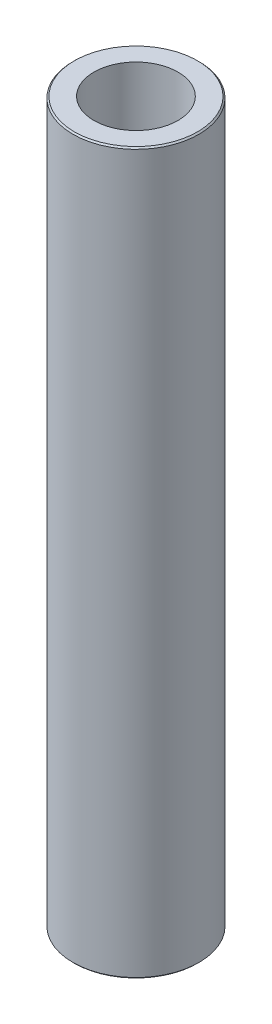
ISO-10303-21;
HEADER;
FILE_DESCRIPTION(('STEP AP214'),'2;1');
FILE_NAME('part.step','',(''),(''),'','','');
FILE_SCHEMA(('AUTOMOTIVE_DESIGN { 1 0 10303 214 1 1 1 1 }'));
ENDSEC;
DATA;
#1=APPLICATION_CONTEXT('core data for automotive mechanical design processes');
#2=APPLICATION_PROTOCOL_DEFINITION('international standard','automotive_design',2000,#1);
#3=PRODUCT_CONTEXT('',#1,'mechanical');
#4=PRODUCT('Part','Part','',(#3));
#5=PRODUCT_RELATED_PRODUCT_CATEGORY('part','',(#4));
#6=PRODUCT_DEFINITION_FORMATION('','',#4);
#7=PRODUCT_DEFINITION_CONTEXT('part definition',#1,'design');
#8=PRODUCT_DEFINITION('design','',#6,#7);
#9=PRODUCT_DEFINITION_SHAPE('','',#8);
#10=(LENGTH_UNIT() NAMED_UNIT(*) SI_UNIT(.MILLI.,.METRE.));
#11=(NAMED_UNIT(*) PLANE_ANGLE_UNIT() SI_UNIT($,.RADIAN.));
#12=(NAMED_UNIT(*) SI_UNIT($,.STERADIAN.) SOLID_ANGLE_UNIT());
#13=UNCERTAINTY_MEASURE_WITH_UNIT(LENGTH_MEASURE(1.E-05),#10,'distance_accuracy_value','');
#14=(GEOMETRIC_REPRESENTATION_CONTEXT(3) GLOBAL_UNCERTAINTY_ASSIGNED_CONTEXT((#13)) GLOBAL_UNIT_ASSIGNED_CONTEXT((#10,
#11,#12)) REPRESENTATION_CONTEXT('',''));
#15=CARTESIAN_POINT('',(0.,0.,0.));
#16=DIRECTION('',(0.,0.,1.));
#17=DIRECTION('',(1.,0.,0.));
#18=AXIS2_PLACEMENT_3D('',#15,#16,#17);
#19=CARTESIAN_POINT('',(0.,600.,0.));
#20=DIRECTION('',(0.,-1.,0.));
#21=DIRECTION('',(0.,0.,-1.));
#22=AXIS2_PLACEMENT_3D('',#19,#20,#21);
#23=CYLINDRICAL_SURFACE('',#22,52.5);
#24=CARTESIAN_POINT('',(0.,598.818319468734,0.));
#25=DIRECTION('',(0.,1.,0.));
#26=DIRECTION('',(0.,0.,1.));
#27=AXIS2_PLACEMENT_3D('',#24,#25,#26);
#28=CIRCLE('',#27,52.5);
#29=CARTESIAN_POINT('',(0.,598.818319468734,52.5));
#30=VERTEX_POINT('',#29);
#31=EDGE_CURVE('E50',#30,#30,#28,.F.);
#32=ORIENTED_EDGE('',*,*,#31,.T.);
#33=EDGE_LOOP('',(#32));
#34=FACE_BOUND('',#33,.T.);
#35=CARTESIAN_POINT('',(0.,1.18168053126599,0.));
#36=DIRECTION('',(0.,1.,0.));
#37=DIRECTION('',(0.,0.,1.));
#38=AXIS2_PLACEMENT_3D('',#35,#36,#37);
#39=CIRCLE('',#38,52.5);
#40=CARTESIAN_POINT('',(0.,1.18168053126599,52.5));
#41=VERTEX_POINT('',#40);
#42=EDGE_CURVE('E51',#41,#41,#39,.T.);
#43=ORIENTED_EDGE('',*,*,#42,.T.);
#44=EDGE_LOOP('',(#43));
#45=FACE_BOUND('',#44,.T.);
#46=ADVANCED_FACE('F39',(#34,#45),#23,.T.);
#47=CARTESIAN_POINT('',(0.,600.,0.));
#48=DIRECTION('',(0.,1.,0.));
#49=DIRECTION('',(0.,0.,1.));
#50=AXIS2_PLACEMENT_3D('',#47,#48,#49);
#51=PLANE('',#50);
#52=CARTESIAN_POINT('',(0.,600.,0.));
#53=DIRECTION('',(0.,1.,0.));
#54=DIRECTION('',(0.,0.,1.));
#55=AXIS2_PLACEMENT_3D('',#52,#53,#54);
#56=CIRCLE('',#55,51.3183194687339);
#57=CARTESIAN_POINT('',(0.,600.,51.3183194687339));
#58=VERTEX_POINT('',#57);
#59=EDGE_CURVE('E54',#58,#58,#56,.T.);
#60=ORIENTED_EDGE('',*,*,#59,.T.);
#61=EDGE_LOOP('',(#60));
#62=FACE_BOUND('',#61,.T.);
#63=CARTESIAN_POINT('',(0.,600.,0.));
#64=DIRECTION('',(0.,1.,0.));
#65=DIRECTION('',(0.,0.,1.));
#66=AXIS2_PLACEMENT_3D('',#63,#64,#65);
#67=CIRCLE('',#66,35.0089186916759);
#68=CARTESIAN_POINT('',(0.,600.,35.0089186916759));
#69=VERTEX_POINT('',#68);
#70=EDGE_CURVE('E58',#69,#69,#67,.T.);
#71=ORIENTED_EDGE('',*,*,#70,.F.);
#72=EDGE_LOOP('',(#71));
#73=FACE_BOUND('',#72,.T.);
#74=ADVANCED_FACE('F69',(#62,#73),#51,.T.);
#75=CARTESIAN_POINT('',(0.,0.,0.));
#76=DIRECTION('',(0.,1.,0.));
#77=DIRECTION('',(0.,0.,1.));
#78=AXIS2_PLACEMENT_3D('',#75,#76,#77);
#79=PLANE('',#78);
#80=CARTESIAN_POINT('',(0.,0.,0.));
#81=DIRECTION('',(0.,1.,0.));
#82=DIRECTION('',(0.,0.,1.));
#83=AXIS2_PLACEMENT_3D('',#80,#81,#82);
#84=CIRCLE('',#83,51.3183194687339);
#85=CARTESIAN_POINT('',(0.,0.,51.3183194687339));
#86=VERTEX_POINT('',#85);
#87=EDGE_CURVE('E10',#86,#86,#84,.F.);
#88=ORIENTED_EDGE('',*,*,#87,.T.);
#89=EDGE_LOOP('',(#88));
#90=FACE_BOUND('',#89,.T.);
#91=CARTESIAN_POINT('',(0.,0.,0.));
#92=DIRECTION('',(0.,1.,0.));
#93=DIRECTION('',(0.,0.,1.));
#94=AXIS2_PLACEMENT_3D('',#91,#92,#93);
#95=CIRCLE('',#94,35.0089186916759);
#96=CARTESIAN_POINT('',(0.,0.,35.0089186916759));
#97=VERTEX_POINT('',#96);
#98=EDGE_CURVE('E63',#97,#97,#95,.T.);
#99=ORIENTED_EDGE('',*,*,#98,.T.);
#100=EDGE_LOOP('',(#99));
#101=FACE_BOUND('',#100,.T.);
#102=ADVANCED_FACE('F75',(#90,#101),#79,.F.);
#103=CARTESIAN_POINT('',(0.,600.,0.));
#104=DIRECTION('',(0.,-1.,0.));
#105=DIRECTION('',(0.,0.,-1.));
#106=AXIS2_PLACEMENT_3D('',#103,#104,#105);
#107=CYLINDRICAL_SURFACE('',#106,35.0089186916759);
#108=ORIENTED_EDGE('',*,*,#70,.T.);
#109=EDGE_LOOP('',(#108));
#110=FACE_BOUND('',#109,.T.);
#111=ORIENTED_EDGE('',*,*,#98,.F.);
#112=EDGE_LOOP('',(#111));
#113=FACE_BOUND('',#112,.T.);
#114=ADVANCED_FACE('F70',(#110,#113),#107,.F.);
#115=CARTESIAN_POINT('',(0.,600.,0.));
#116=DIRECTION('',(0.,-1.,0.));
#117=DIRECTION('',(0.,0.,-1.));
#118=AXIS2_PLACEMENT_3D('',#115,#116,#117);
#119=CONICAL_SURFACE('',#118,51.3183194687339,0.785398163397448);
#120=ORIENTED_EDGE('',*,*,#31,.F.);
#121=EDGE_LOOP('',(#120));
#122=FACE_BOUND('',#121,.T.);
#123=ORIENTED_EDGE('',*,*,#59,.F.);
#124=EDGE_LOOP('',(#123));
#125=FACE_BOUND('',#124,.T.);
#126=ADVANCED_FACE('F81',(#122,#125),#119,.T.);
#127=CARTESIAN_POINT('',(0.,1.18168053126599,0.));
#128=DIRECTION('',(0.,1.,0.));
#129=DIRECTION('',(0.,0.,1.));
#130=AXIS2_PLACEMENT_3D('',#127,#128,#129);
#131=CONICAL_SURFACE('',#130,52.5,0.785398163397475);
#132=ORIENTED_EDGE('',*,*,#87,.F.);
#133=EDGE_LOOP('',(#132));
#134=FACE_BOUND('',#133,.T.);
#135=ORIENTED_EDGE('',*,*,#42,.F.);
#136=EDGE_LOOP('',(#135));
#137=FACE_BOUND('',#136,.T.);
#138=ADVANCED_FACE('F45',(#134,#137),#131,.T.);
#139=CLOSED_SHELL('',(#46,#74,#102,#114,#126,#138));
#140=MANIFOLD_SOLID_BREP('B2',#139);
#141=ADVANCED_BREP_SHAPE_REPRESENTATION('',(#18,#140),#14);
#142=SHAPE_DEFINITION_REPRESENTATION(#9,#141);
ENDSEC;
END-ISO-10303-21;
